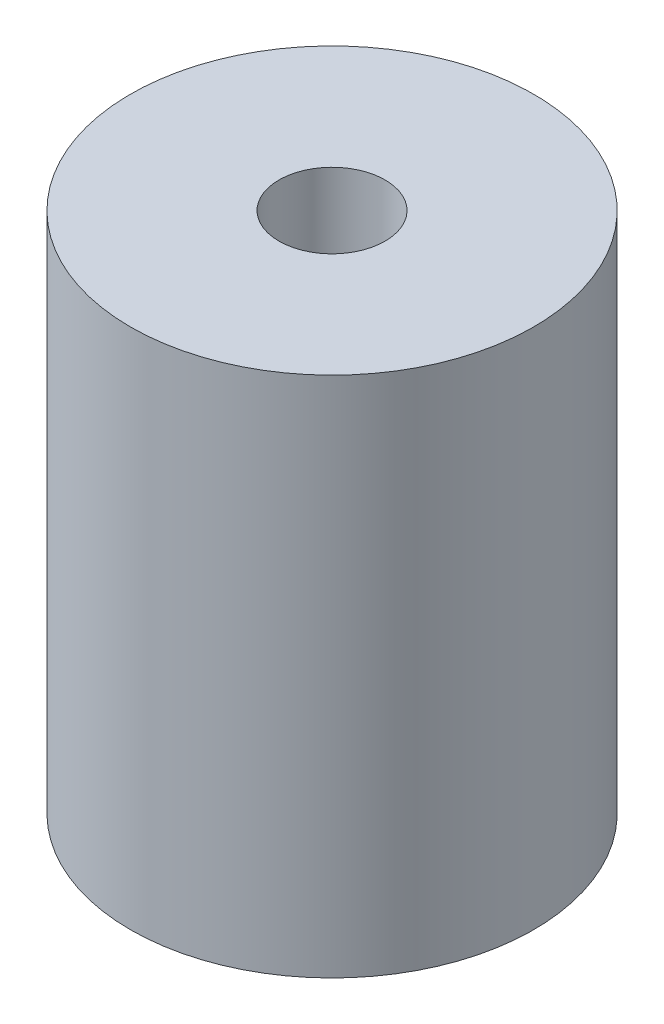
ISO-10303-21;
HEADER;
FILE_DESCRIPTION(('STEP AP214'),'2;1');
FILE_NAME('part.step','',(''),(''),'','','');
FILE_SCHEMA(('AUTOMOTIVE_DESIGN { 1 0 10303 214 1 1 1 1 }'));
ENDSEC;
DATA;
#1=APPLICATION_CONTEXT('core data for automotive mechanical design processes');
#2=APPLICATION_PROTOCOL_DEFINITION('international standard','automotive_design',2000,#1);
#3=PRODUCT_CONTEXT('',#1,'mechanical');
#4=PRODUCT('Part','Part','',(#3));
#5=PRODUCT_RELATED_PRODUCT_CATEGORY('part','',(#4));
#6=PRODUCT_DEFINITION_FORMATION('','',#4);
#7=PRODUCT_DEFINITION_CONTEXT('part definition',#1,'design');
#8=PRODUCT_DEFINITION('design','',#6,#7);
#9=PRODUCT_DEFINITION_SHAPE('','',#8);
#10=(LENGTH_UNIT() NAMED_UNIT(*) SI_UNIT(.MILLI.,.METRE.));
#11=(NAMED_UNIT(*) PLANE_ANGLE_UNIT() SI_UNIT($,.RADIAN.));
#12=(NAMED_UNIT(*) SI_UNIT($,.STERADIAN.) SOLID_ANGLE_UNIT());
#13=UNCERTAINTY_MEASURE_WITH_UNIT(LENGTH_MEASURE(1.E-05),#10,'distance_accuracy_value','');
#14=(GEOMETRIC_REPRESENTATION_CONTEXT(3) GLOBAL_UNCERTAINTY_ASSIGNED_CONTEXT((#13)) GLOBAL_UNIT_ASSIGNED_CONTEXT((#10,
#11,#12)) REPRESENTATION_CONTEXT('',''));
#15=CARTESIAN_POINT('',(0.,0.,0.));
#16=DIRECTION('',(0.,0.,1.));
#17=DIRECTION('',(1.,0.,0.));
#18=AXIS2_PLACEMENT_3D('',#15,#16,#17);
#19=CARTESIAN_POINT('',(0.,-0.001000000000001,0.));
#20=DIRECTION('',(0.,1.,0.));
#21=DIRECTION('',(0.,0.,1.));
#22=AXIS2_PLACEMENT_3D('',#19,#20,#21);
#23=CYLINDRICAL_SURFACE('',#22,2.5);
#24=CARTESIAN_POINT('',(0.,24.6,0.));
#25=DIRECTION('',(0.,1.,0.));
#26=DIRECTION('',(0.,0.,1.));
#27=AXIS2_PLACEMENT_3D('',#24,#25,#26);
#28=CIRCLE('',#27,2.5);
#29=CARTESIAN_POINT('',(0.,24.6,2.5));
#30=VERTEX_POINT('',#29);
#31=EDGE_CURVE('E44',#30,#30,#28,.T.);
#32=ORIENTED_EDGE('',*,*,#31,.T.);
#33=EDGE_LOOP('',(#32));
#34=FACE_BOUND('',#33,.T.);
#35=CARTESIAN_POINT('',(0.,17.25,0.));
#36=DIRECTION('',(0.,-1.,0.));
#37=DIRECTION('',(0.,0.,-1.));
#38=AXIS2_PLACEMENT_3D('',#35,#36,#37);
#39=CIRCLE('',#38,2.5);
#40=CARTESIAN_POINT('',(0.,17.25,-2.5));
#41=VERTEX_POINT('',#40);
#42=EDGE_CURVE('E35',#41,#41,#39,.F.);
#43=ORIENTED_EDGE('',*,*,#42,.F.);
#44=EDGE_LOOP('',(#43));
#45=FACE_BOUND('',#44,.T.);
#46=ADVANCED_FACE('F31',(#34,#45),#23,.F.);
#47=CARTESIAN_POINT('',(0.,24.6,0.));
#48=DIRECTION('',(0.,-1.,0.));
#49=DIRECTION('',(0.,0.,-1.));
#50=AXIS2_PLACEMENT_3D('',#47,#48,#49);
#51=CYLINDRICAL_SURFACE('',#50,9.5);
#52=CARTESIAN_POINT('',(0.,24.6,0.));
#53=DIRECTION('',(0.,1.,0.));
#54=DIRECTION('',(0.,0.,1.));
#55=AXIS2_PLACEMENT_3D('',#52,#53,#54);
#56=CIRCLE('',#55,9.5);
#57=CARTESIAN_POINT('',(0.,24.6,9.5));
#58=VERTEX_POINT('',#57);
#59=EDGE_CURVE('E10',#58,#58,#56,.T.);
#60=ORIENTED_EDGE('',*,*,#59,.F.);
#61=EDGE_LOOP('',(#60));
#62=FACE_BOUND('',#61,.T.);
#63=CARTESIAN_POINT('',(0.,0.,0.));
#64=DIRECTION('',(0.,1.,0.));
#65=DIRECTION('',(0.,0.,1.));
#66=AXIS2_PLACEMENT_3D('',#63,#64,#65);
#67=CIRCLE('',#66,9.5);
#68=CARTESIAN_POINT('',(0.,0.,9.5));
#69=VERTEX_POINT('',#68);
#70=EDGE_CURVE('E39',#69,#69,#67,.T.);
#71=ORIENTED_EDGE('',*,*,#70,.T.);
#72=EDGE_LOOP('',(#71));
#73=FACE_BOUND('',#72,.T.);
#74=ADVANCED_FACE('F33',(#62,#73),#51,.T.);
#75=CARTESIAN_POINT('',(0.,24.6,0.));
#76=DIRECTION('',(0.,1.,0.));
#77=DIRECTION('',(0.,0.,1.));
#78=AXIS2_PLACEMENT_3D('',#75,#76,#77);
#79=PLANE('',#78);
#80=ORIENTED_EDGE('',*,*,#31,.F.);
#81=EDGE_LOOP('',(#80));
#82=FACE_BOUND('',#81,.T.);
#83=ORIENTED_EDGE('',*,*,#59,.T.);
#84=EDGE_LOOP('',(#83));
#85=FACE_BOUND('',#84,.T.);
#86=ADVANCED_FACE('F66',(#82,#85),#79,.T.);
#87=CARTESIAN_POINT('',(0.,0.,0.));
#88=DIRECTION('',(0.,1.,0.));
#89=DIRECTION('',(0.,0.,1.));
#90=AXIS2_PLACEMENT_3D('',#87,#88,#89);
#91=PLANE('',#90);
#92=CARTESIAN_POINT('',(0.,0.,0.));
#93=DIRECTION('',(0.,-1.,0.));
#94=DIRECTION('',(0.,0.,-1.));
#95=AXIS2_PLACEMENT_3D('',#92,#93,#94);
#96=CIRCLE('',#95,4.);
#97=CARTESIAN_POINT('',(0.,0.,-4.));
#98=VERTEX_POINT('',#97);
#99=EDGE_CURVE('E48',#98,#98,#96,.T.);
#100=ORIENTED_EDGE('',*,*,#99,.F.);
#101=EDGE_LOOP('',(#100));
#102=FACE_BOUND('',#101,.T.);
#103=ORIENTED_EDGE('',*,*,#70,.F.);
#104=EDGE_LOOP('',(#103));
#105=FACE_BOUND('',#104,.T.);
#106=ADVANCED_FACE('F73',(#102,#105),#91,.F.);
#107=CARTESIAN_POINT('',(0.,17.25,0.));
#108=DIRECTION('',(0.,-1.,0.));
#109=DIRECTION('',(0.,0.,-1.));
#110=AXIS2_PLACEMENT_3D('',#107,#108,#109);
#111=PLANE('',#110);
#112=CARTESIAN_POINT('',(0.,17.25,0.));
#113=DIRECTION('',(0.,-1.,0.));
#114=DIRECTION('',(0.,0.,-1.));
#115=AXIS2_PLACEMENT_3D('',#112,#113,#114);
#116=CIRCLE('',#115,4.);
#117=CARTESIAN_POINT('',(0.,17.25,-4.));
#118=VERTEX_POINT('',#117);
#119=EDGE_CURVE('E51',#118,#118,#116,.T.);
#120=ORIENTED_EDGE('',*,*,#119,.T.);
#121=EDGE_LOOP('',(#120));
#122=FACE_BOUND('',#121,.T.);
#123=ORIENTED_EDGE('',*,*,#42,.T.);
#124=EDGE_LOOP('',(#123));
#125=FACE_BOUND('',#124,.T.);
#126=ADVANCED_FACE('F58',(#122,#125),#111,.T.);
#127=CARTESIAN_POINT('',(0.,17.25,0.));
#128=DIRECTION('',(0.,-1.,0.));
#129=DIRECTION('',(0.,0.,-1.));
#130=AXIS2_PLACEMENT_3D('',#127,#128,#129);
#131=CYLINDRICAL_SURFACE('',#130,4.);
#132=ORIENTED_EDGE('',*,*,#119,.F.);
#133=EDGE_LOOP('',(#132));
#134=FACE_BOUND('',#133,.T.);
#135=ORIENTED_EDGE('',*,*,#99,.T.);
#136=EDGE_LOOP('',(#135));
#137=FACE_BOUND('',#136,.T.);
#138=ADVANCED_FACE('F70',(#134,#137),#131,.F.);
#139=CLOSED_SHELL('',(#46,#74,#86,#106,#126,#138));
#140=MANIFOLD_SOLID_BREP('B2',#139);
#141=ADVANCED_BREP_SHAPE_REPRESENTATION('',(#18,#140),#14);
#142=SHAPE_DEFINITION_REPRESENTATION(#9,#141);
ENDSEC;
END-ISO-10303-21;
